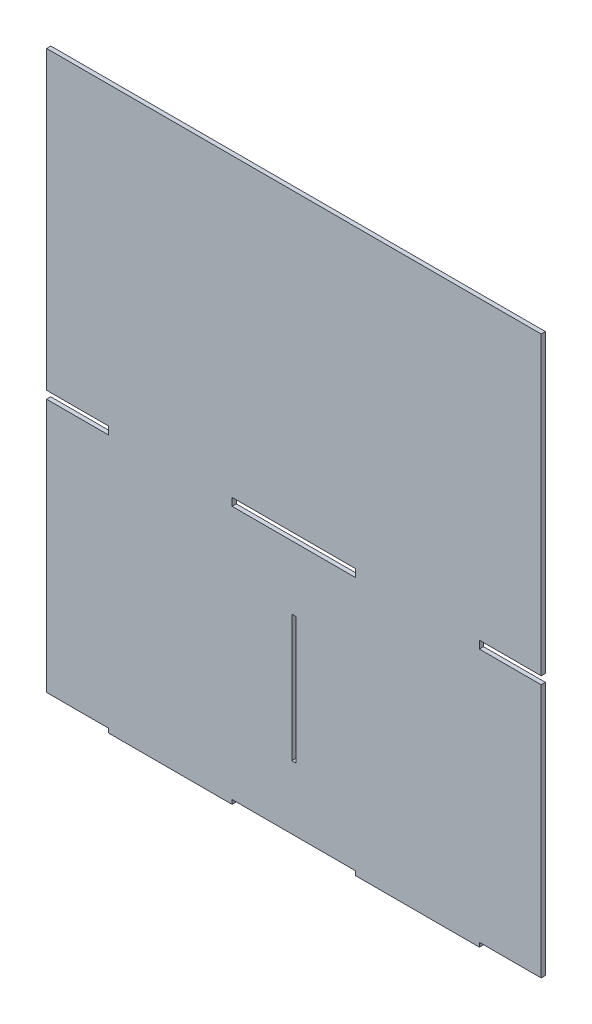
ISO-10303-21;
HEADER;
FILE_DESCRIPTION(('STEP AP214'),'2;1');
FILE_NAME('part.step','',(''),(''),'','','');
FILE_SCHEMA(('AUTOMOTIVE_DESIGN { 1 0 10303 214 1 1 1 1 }'));
ENDSEC;
DATA;
#1=APPLICATION_CONTEXT('core data for automotive mechanical design processes');
#2=APPLICATION_PROTOCOL_DEFINITION('international standard','automotive_design',2000,#1);
#3=PRODUCT_CONTEXT('',#1,'mechanical');
#4=PRODUCT('Part','Part','',(#3));
#5=PRODUCT_RELATED_PRODUCT_CATEGORY('part','',(#4));
#6=PRODUCT_DEFINITION_FORMATION('','',#4);
#7=PRODUCT_DEFINITION_CONTEXT('part definition',#1,'design');
#8=PRODUCT_DEFINITION('design','',#6,#7);
#9=PRODUCT_DEFINITION_SHAPE('','',#8);
#10=(LENGTH_UNIT() NAMED_UNIT(*) SI_UNIT(.MILLI.,.METRE.));
#11=(NAMED_UNIT(*) PLANE_ANGLE_UNIT() SI_UNIT($,.RADIAN.));
#12=(NAMED_UNIT(*) SI_UNIT($,.STERADIAN.) SOLID_ANGLE_UNIT());
#13=UNCERTAINTY_MEASURE_WITH_UNIT(LENGTH_MEASURE(1.E-05),#10,'distance_accuracy_value','');
#14=(GEOMETRIC_REPRESENTATION_CONTEXT(3) GLOBAL_UNCERTAINTY_ASSIGNED_CONTEXT((#13)) GLOBAL_UNIT_ASSIGNED_CONTEXT((#10,
#11,#12)) REPRESENTATION_CONTEXT('',''));
#15=CARTESIAN_POINT('',(0.,0.,0.));
#16=DIRECTION('',(0.,0.,1.));
#17=DIRECTION('',(1.,0.,0.));
#18=AXIS2_PLACEMENT_3D('',#15,#16,#17);
#19=CARTESIAN_POINT('',(0.,0.,3.));
#20=DIRECTION('',(0.,0.,-1.));
#21=DIRECTION('',(-1.,0.,0.));
#22=AXIS2_PLACEMENT_3D('',#19,#20,#21);
#23=PLANE('',#22);
#24=DIRECTION('',(1.,0.,0.));
#25=VECTOR('',#24,1.);
#26=CARTESIAN_POINT('',(-220.0509550125,180.76244654,3.));
#27=LINE('',#26,#25);
#28=CARTESIAN_POINT('',(-220.0509550125,180.76244654,3.));
#29=VERTEX_POINT('',#28);
#30=CARTESIAN_POINT('',(-132.0305730075,180.76244654,3.));
#31=VERTEX_POINT('',#30);
#32=EDGE_CURVE('E253',#29,#31,#27,.T.);
#33=ORIENTED_EDGE('',*,*,#32,.F.);
#34=DIRECTION('',(0.,-1.,0.));
#35=VECTOR('',#34,1.);
#36=CARTESIAN_POINT('',(-220.0509550125,186.26244654,3.));
#37=LINE('',#36,#35);
#38=CARTESIAN_POINT('',(-220.0509550125,186.26244654,3.));
#39=VERTEX_POINT('',#38);
#40=EDGE_CURVE('E261',#39,#29,#37,.T.);
#41=ORIENTED_EDGE('',*,*,#40,.F.);
#42=DIRECTION('',(-1.,0.,0.));
#43=VECTOR('',#42,1.);
#44=CARTESIAN_POINT('',(-220.0509550125,186.26244654,3.));
#45=LINE('',#44,#43);
#46=CARTESIAN_POINT('',(-132.0305730075,186.26244654,3.));
#47=VERTEX_POINT('',#46);
#48=EDGE_CURVE('E258',#47,#39,#45,.T.);
#49=ORIENTED_EDGE('',*,*,#48,.F.);
#50=DIRECTION('',(0.,1.,0.));
#51=VECTOR('',#50,1.);
#52=CARTESIAN_POINT('',(-132.0305730075,186.26244654,3.));
#53=LINE('',#52,#51);
#54=EDGE_CURVE('E255',#31,#47,#53,.T.);
#55=ORIENTED_EDGE('',*,*,#54,.F.);
#56=EDGE_LOOP('',(#33,#41,#49,#55));
#57=FACE_BOUND('',#56,.T.);
#58=DIRECTION('',(0.,1.,0.));
#59=VECTOR('',#58,1.);
#60=CARTESIAN_POINT('',(0.,0.,3.));
#61=LINE('',#60,#59);
#62=CARTESIAN_POINT('',(0.,0.,3.));
#63=VERTEX_POINT('',#62);
#64=CARTESIAN_POINT('',(0.,180.76244654,3.));
#65=VERTEX_POINT('',#64);
#66=EDGE_CURVE('E284',#63,#65,#61,.T.);
#67=ORIENTED_EDGE('',*,*,#66,.T.);
#68=DIRECTION('',(-1.,0.,0.));
#69=VECTOR('',#68,1.);
#70=CARTESIAN_POINT('',(-44.0101910024998,180.76244654,3.));
#71=LINE('',#70,#69);
#72=CARTESIAN_POINT('',(-44.0101910024998,180.76244654,3.));
#73=VERTEX_POINT('',#72);
#74=EDGE_CURVE('E287',#65,#73,#71,.T.);
#75=ORIENTED_EDGE('',*,*,#74,.T.);
#76=DIRECTION('',(0.,1.,0.));
#77=VECTOR('',#76,1.);
#78=CARTESIAN_POINT('',(-44.0101910024999,186.26244654,3.));
#79=LINE('',#78,#77);
#80=CARTESIAN_POINT('',(-44.0101910024999,186.26244654,3.));
#81=VERTEX_POINT('',#80);
#82=EDGE_CURVE('E290',#73,#81,#79,.T.);
#83=ORIENTED_EDGE('',*,*,#82,.T.);
#84=DIRECTION('',(1.,0.,0.));
#85=VECTOR('',#84,1.);
#86=CARTESIAN_POINT('',(-44.0101910024999,186.26244654,3.));
#87=LINE('',#86,#85);
#88=CARTESIAN_POINT('',(0.,186.26244654,3.));
#89=VERTEX_POINT('',#88);
#90=EDGE_CURVE('E292',#81,#89,#87,.T.);
#91=ORIENTED_EDGE('',*,*,#90,.T.);
#92=DIRECTION('',(0.,1.,0.));
#93=VECTOR('',#92,1.);
#94=CARTESIAN_POINT('',(0.,186.26244654,3.));
#95=LINE('',#94,#93);
#96=CARTESIAN_POINT('',(0.,397.,3.));
#97=VERTEX_POINT('',#96);
#98=EDGE_CURVE('E294',#89,#97,#95,.T.);
#99=ORIENTED_EDGE('',*,*,#98,.T.);
#100=DIRECTION('',(-1.,0.,0.));
#101=VECTOR('',#100,1.);
#102=CARTESIAN_POINT('',(0.,397.,3.));
#103=LINE('',#102,#101);
#104=CARTESIAN_POINT('',(-352.08152802,397.,3.));
#105=VERTEX_POINT('',#104);
#106=EDGE_CURVE('E296',#97,#105,#103,.T.);
#107=ORIENTED_EDGE('',*,*,#106,.T.);
#108=DIRECTION('',(0.,-1.,0.));
#109=VECTOR('',#108,1.);
#110=CARTESIAN_POINT('',(-352.08152802,186.26244654,3.));
#111=LINE('',#110,#109);
#112=CARTESIAN_POINT('',(-352.08152802,186.26244654,3.));
#113=VERTEX_POINT('',#112);
#114=EDGE_CURVE('E298',#105,#113,#111,.T.);
#115=ORIENTED_EDGE('',*,*,#114,.T.);
#116=DIRECTION('',(1.,0.,0.));
#117=VECTOR('',#116,1.);
#118=CARTESIAN_POINT('',(-308.0713370175,186.26244654,3.));
#119=LINE('',#118,#117);
#120=CARTESIAN_POINT('',(-308.0713370175,186.26244654,3.));
#121=VERTEX_POINT('',#120);
#122=EDGE_CURVE('E300',#113,#121,#119,.T.);
#123=ORIENTED_EDGE('',*,*,#122,.T.);
#124=DIRECTION('',(0.,-1.,0.));
#125=VECTOR('',#124,1.);
#126=CARTESIAN_POINT('',(-308.0713370175,186.26244654,3.));
#127=LINE('',#126,#125);
#128=CARTESIAN_POINT('',(-308.0713370175,180.76244654,3.));
#129=VERTEX_POINT('',#128);
#130=EDGE_CURVE('E302',#121,#129,#127,.T.);
#131=ORIENTED_EDGE('',*,*,#130,.T.);
#132=DIRECTION('',(-1.,0.,0.));
#133=VECTOR('',#132,1.);
#134=CARTESIAN_POINT('',(-308.0713370175,180.76244654,3.));
#135=LINE('',#134,#133);
#136=CARTESIAN_POINT('',(-352.08152802,180.76244654,3.));
#137=VERTEX_POINT('',#136);
#138=EDGE_CURVE('E304',#129,#137,#135,.T.);
#139=ORIENTED_EDGE('',*,*,#138,.T.);
#140=DIRECTION('',(0.,-1.,0.));
#141=VECTOR('',#140,1.);
#142=CARTESIAN_POINT('',(-352.08152802,0.,3.));
#143=LINE('',#142,#141);
#144=CARTESIAN_POINT('',(-352.08152802,0.,3.));
#145=VERTEX_POINT('',#144);
#146=EDGE_CURVE('E306',#137,#145,#143,.T.);
#147=ORIENTED_EDGE('',*,*,#146,.T.);
#148=DIRECTION('',(1.,0.,0.));
#149=VECTOR('',#148,1.);
#150=CARTESIAN_POINT('',(-308.0713370175,0.,3.));
#151=LINE('',#150,#149);
#152=CARTESIAN_POINT('',(-308.0713370175,0.,3.));
#153=VERTEX_POINT('',#152);
#154=EDGE_CURVE('E308',#145,#153,#151,.T.);
#155=ORIENTED_EDGE('',*,*,#154,.T.);
#156=DIRECTION('',(0.,-1.,0.));
#157=VECTOR('',#156,1.);
#158=CARTESIAN_POINT('',(-308.0713370175,0.,3.));
#159=LINE('',#158,#157);
#160=CARTESIAN_POINT('',(-308.0713370175,-3.,3.));
#161=VERTEX_POINT('',#160);
#162=EDGE_CURVE('E310',#153,#161,#159,.T.);
#163=ORIENTED_EDGE('',*,*,#162,.T.);
#164=DIRECTION('',(1.,0.,0.));
#165=VECTOR('',#164,1.);
#166=CARTESIAN_POINT('',(-308.0713370175,-3.,3.));
#167=LINE('',#166,#165);
#168=CARTESIAN_POINT('',(-220.0509550125,-3.,3.));
#169=VERTEX_POINT('',#168);
#170=EDGE_CURVE('E312',#161,#169,#167,.T.);
#171=ORIENTED_EDGE('',*,*,#170,.T.);
#172=DIRECTION('',(0.,1.,0.));
#173=VECTOR('',#172,1.);
#174=CARTESIAN_POINT('',(-220.0509550125,-3.,3.));
#175=LINE('',#174,#173);
#176=CARTESIAN_POINT('',(-220.0509550125,0.,3.));
#177=VERTEX_POINT('',#176);
#178=EDGE_CURVE('E314',#169,#177,#175,.T.);
#179=ORIENTED_EDGE('',*,*,#178,.T.);
#180=DIRECTION('',(1.,0.,0.));
#181=VECTOR('',#180,1.);
#182=CARTESIAN_POINT('',(-132.0313370175,0.,3.));
#183=LINE('',#182,#181);
#184=CARTESIAN_POINT('',(-132.0313370175,0.,3.));
#185=VERTEX_POINT('',#184);
#186=EDGE_CURVE('E316',#177,#185,#183,.T.);
#187=ORIENTED_EDGE('',*,*,#186,.T.);
#188=DIRECTION('',(0.,-1.,0.));
#189=VECTOR('',#188,1.);
#190=CARTESIAN_POINT('',(-132.0313370175,0.,3.));
#191=LINE('',#190,#189);
#192=CARTESIAN_POINT('',(-132.0313370175,-3.,3.));
#193=VERTEX_POINT('',#192);
#194=EDGE_CURVE('E318',#185,#193,#191,.T.);
#195=ORIENTED_EDGE('',*,*,#194,.T.);
#196=DIRECTION('',(1.,0.,0.));
#197=VECTOR('',#196,1.);
#198=CARTESIAN_POINT('',(-132.0313370175,-3.,3.));
#199=LINE('',#198,#197);
#200=CARTESIAN_POINT('',(-44.0109550125,-3.,3.));
#201=VERTEX_POINT('',#200);
#202=EDGE_CURVE('E320',#193,#201,#199,.T.);
#203=ORIENTED_EDGE('',*,*,#202,.T.);
#204=DIRECTION('',(0.,1.,0.));
#205=VECTOR('',#204,1.);
#206=CARTESIAN_POINT('',(-44.0109550125,-3.,3.));
#207=LINE('',#206,#205);
#208=CARTESIAN_POINT('',(-44.0109550125,0.,3.));
#209=VERTEX_POINT('',#208);
#210=EDGE_CURVE('E322',#201,#209,#207,.T.);
#211=ORIENTED_EDGE('',*,*,#210,.T.);
#212=DIRECTION('',(1.,0.,0.));
#213=VECTOR('',#212,1.);
#214=CARTESIAN_POINT('',(0.,0.,3.));
#215=LINE('',#214,#213);
#216=EDGE_CURVE('E324',#209,#63,#215,.T.);
#217=ORIENTED_EDGE('',*,*,#216,.T.);
#218=EDGE_LOOP('',(#67,#75,#83,#91,#99,#107,#115,#123,#131,#139,#147,#155,#163,#171,#179,#187,
#195,#203,#211,#217));
#219=FACE_BOUND('',#218,.T.);
#220=DIRECTION('',(0.,1.,0.));
#221=VECTOR('',#220,1.);
#222=CARTESIAN_POINT('',(-174.54076401,45.190611635,3.));
#223=LINE('',#222,#221);
#224=CARTESIAN_POINT('',(-174.54076401,45.190611635,3.));
#225=VERTEX_POINT('',#224);
#226=CARTESIAN_POINT('',(-174.54076401,135.571834905,3.));
#227=VERTEX_POINT('',#226);
#228=EDGE_CURVE('E217',#225,#227,#223,.T.);
#229=ORIENTED_EDGE('',*,*,#228,.F.);
#230=DIRECTION('',(1.,0.,0.));
#231=VECTOR('',#230,1.);
#232=CARTESIAN_POINT('',(-174.54076401,45.190611635,3.));
#233=LINE('',#232,#231);
#234=CARTESIAN_POINT('',(-177.54076401,45.190611635,3.));
#235=VERTEX_POINT('',#234);
#236=EDGE_CURVE('E239',#235,#225,#233,.T.);
#237=ORIENTED_EDGE('',*,*,#236,.F.);
#238=DIRECTION('',(0.,-1.,0.));
#239=VECTOR('',#238,1.);
#240=CARTESIAN_POINT('',(-177.54076401,45.190611635,3.));
#241=LINE('',#240,#239);
#242=CARTESIAN_POINT('',(-177.54076401,135.571834905,3.));
#243=VERTEX_POINT('',#242);
#244=EDGE_CURVE('E237',#243,#235,#241,.T.);
#245=ORIENTED_EDGE('',*,*,#244,.F.);
#246=DIRECTION('',(-1.,0.,0.));
#247=VECTOR('',#246,1.);
#248=CARTESIAN_POINT('',(-174.54076401,135.571834905,3.));
#249=LINE('',#248,#247);
#250=EDGE_CURVE('E225',#227,#243,#249,.T.);
#251=ORIENTED_EDGE('',*,*,#250,.F.);
#252=EDGE_LOOP('',(#229,#237,#245,#251));
#253=FACE_BOUND('',#252,.T.);
#254=ADVANCED_FACE('F32',(#57,#219,#253),#23,.F.);
#255=CARTESIAN_POINT('',(0.,0.,0.));
#256=DIRECTION('',(0.,0.,-1.));
#257=DIRECTION('',(-1.,0.,0.));
#258=AXIS2_PLACEMENT_3D('',#255,#256,#257);
#259=PLANE('',#258);
#260=DIRECTION('',(0.,1.,0.));
#261=VECTOR('',#260,1.);
#262=CARTESIAN_POINT('',(0.,0.,0.));
#263=LINE('',#262,#261);
#264=CARTESIAN_POINT('',(0.,0.,0.));
#265=VERTEX_POINT('',#264);
#266=CARTESIAN_POINT('',(0.,180.76244654,0.));
#267=VERTEX_POINT('',#266);
#268=EDGE_CURVE('E283',#265,#267,#263,.T.);
#269=ORIENTED_EDGE('',*,*,#268,.F.);
#270=DIRECTION('',(1.,0.,0.));
#271=VECTOR('',#270,1.);
#272=CARTESIAN_POINT('',(0.,0.,0.));
#273=LINE('',#272,#271);
#274=CARTESIAN_POINT('',(-44.0109550125,0.,0.));
#275=VERTEX_POINT('',#274);
#276=EDGE_CURVE('E288',#275,#265,#273,.T.);
#277=ORIENTED_EDGE('',*,*,#276,.F.);
#278=DIRECTION('',(0.,1.,0.));
#279=VECTOR('',#278,1.);
#280=CARTESIAN_POINT('',(-44.0109550125,-3.,0.));
#281=LINE('',#280,#279);
#282=CARTESIAN_POINT('',(-44.0109550125,-3.,0.));
#283=VERTEX_POINT('',#282);
#284=EDGE_CURVE('E363',#283,#275,#281,.T.);
#285=ORIENTED_EDGE('',*,*,#284,.F.);
#286=DIRECTION('',(1.,0.,0.));
#287=VECTOR('',#286,1.);
#288=CARTESIAN_POINT('',(-132.0313370175,-3.,0.));
#289=LINE('',#288,#287);
#290=CARTESIAN_POINT('',(-132.0313370175,-3.,0.));
#291=VERTEX_POINT('',#290);
#292=EDGE_CURVE('E361',#291,#283,#289,.T.);
#293=ORIENTED_EDGE('',*,*,#292,.F.);
#294=DIRECTION('',(0.,-1.,0.));
#295=VECTOR('',#294,1.);
#296=CARTESIAN_POINT('',(-132.0313370175,0.,0.));
#297=LINE('',#296,#295);
#298=CARTESIAN_POINT('',(-132.0313370175,0.,0.));
#299=VERTEX_POINT('',#298);
#300=EDGE_CURVE('E359',#299,#291,#297,.T.);
#301=ORIENTED_EDGE('',*,*,#300,.F.);
#302=DIRECTION('',(1.,0.,0.));
#303=VECTOR('',#302,1.);
#304=CARTESIAN_POINT('',(-132.0313370175,0.,0.));
#305=LINE('',#304,#303);
#306=CARTESIAN_POINT('',(-220.0509550125,0.,0.));
#307=VERTEX_POINT('',#306);
#308=EDGE_CURVE('E357',#307,#299,#305,.T.);
#309=ORIENTED_EDGE('',*,*,#308,.F.);
#310=DIRECTION('',(0.,1.,0.));
#311=VECTOR('',#310,1.);
#312=CARTESIAN_POINT('',(-220.0509550125,-3.,0.));
#313=LINE('',#312,#311);
#314=CARTESIAN_POINT('',(-220.0509550125,-3.,0.));
#315=VERTEX_POINT('',#314);
#316=EDGE_CURVE('E355',#315,#307,#313,.T.);
#317=ORIENTED_EDGE('',*,*,#316,.F.);
#318=DIRECTION('',(1.,0.,0.));
#319=VECTOR('',#318,1.);
#320=CARTESIAN_POINT('',(-308.0713370175,-3.,0.));
#321=LINE('',#320,#319);
#322=CARTESIAN_POINT('',(-308.0713370175,-3.,0.));
#323=VERTEX_POINT('',#322);
#324=EDGE_CURVE('E353',#323,#315,#321,.T.);
#325=ORIENTED_EDGE('',*,*,#324,.F.);
#326=DIRECTION('',(0.,-1.,0.));
#327=VECTOR('',#326,1.);
#328=CARTESIAN_POINT('',(-308.0713370175,0.,0.));
#329=LINE('',#328,#327);
#330=CARTESIAN_POINT('',(-308.0713370175,0.,0.));
#331=VERTEX_POINT('',#330);
#332=EDGE_CURVE('E351',#331,#323,#329,.T.);
#333=ORIENTED_EDGE('',*,*,#332,.F.);
#334=DIRECTION('',(1.,0.,0.));
#335=VECTOR('',#334,1.);
#336=CARTESIAN_POINT('',(-308.0713370175,0.,0.));
#337=LINE('',#336,#335);
#338=CARTESIAN_POINT('',(-352.08152802,0.,0.));
#339=VERTEX_POINT('',#338);
#340=EDGE_CURVE('E349',#339,#331,#337,.T.);
#341=ORIENTED_EDGE('',*,*,#340,.F.);
#342=DIRECTION('',(0.,-1.,0.));
#343=VECTOR('',#342,1.);
#344=CARTESIAN_POINT('',(-352.08152802,0.,0.));
#345=LINE('',#344,#343);
#346=CARTESIAN_POINT('',(-352.08152802,180.76244654,0.));
#347=VERTEX_POINT('',#346);
#348=EDGE_CURVE('E347',#347,#339,#345,.T.);
#349=ORIENTED_EDGE('',*,*,#348,.F.);
#350=DIRECTION('',(-1.,0.,0.));
#351=VECTOR('',#350,1.);
#352=CARTESIAN_POINT('',(-308.0713370175,180.76244654,0.));
#353=LINE('',#352,#351);
#354=CARTESIAN_POINT('',(-308.0713370175,180.76244654,0.));
#355=VERTEX_POINT('',#354);
#356=EDGE_CURVE('E345',#355,#347,#353,.T.);
#357=ORIENTED_EDGE('',*,*,#356,.F.);
#358=DIRECTION('',(0.,-1.,0.));
#359=VECTOR('',#358,1.);
#360=CARTESIAN_POINT('',(-308.0713370175,186.26244654,0.));
#361=LINE('',#360,#359);
#362=CARTESIAN_POINT('',(-308.0713370175,186.26244654,0.));
#363=VERTEX_POINT('',#362);
#364=EDGE_CURVE('E343',#363,#355,#361,.T.);
#365=ORIENTED_EDGE('',*,*,#364,.F.);
#366=DIRECTION('',(1.,0.,0.));
#367=VECTOR('',#366,1.);
#368=CARTESIAN_POINT('',(-308.0713370175,186.26244654,0.));
#369=LINE('',#368,#367);
#370=CARTESIAN_POINT('',(-352.08152802,186.26244654,0.));
#371=VERTEX_POINT('',#370);
#372=EDGE_CURVE('E341',#371,#363,#369,.T.);
#373=ORIENTED_EDGE('',*,*,#372,.F.);
#374=DIRECTION('',(0.,-1.,0.));
#375=VECTOR('',#374,1.);
#376=CARTESIAN_POINT('',(-352.08152802,186.26244654,0.));
#377=LINE('',#376,#375);
#378=CARTESIAN_POINT('',(-352.08152802,397.,0.));
#379=VERTEX_POINT('',#378);
#380=EDGE_CURVE('E339',#379,#371,#377,.T.);
#381=ORIENTED_EDGE('',*,*,#380,.F.);
#382=DIRECTION('',(-1.,0.,0.));
#383=VECTOR('',#382,1.);
#384=CARTESIAN_POINT('',(0.,397.,0.));
#385=LINE('',#384,#383);
#386=CARTESIAN_POINT('',(0.,397.,0.));
#387=VERTEX_POINT('',#386);
#388=EDGE_CURVE('E337',#387,#379,#385,.T.);
#389=ORIENTED_EDGE('',*,*,#388,.F.);
#390=DIRECTION('',(0.,1.,0.));
#391=VECTOR('',#390,1.);
#392=CARTESIAN_POINT('',(0.,186.26244654,0.));
#393=LINE('',#392,#391);
#394=CARTESIAN_POINT('',(0.,186.26244654,0.));
#395=VERTEX_POINT('',#394);
#396=EDGE_CURVE('E335',#395,#387,#393,.T.);
#397=ORIENTED_EDGE('',*,*,#396,.F.);
#398=DIRECTION('',(1.,0.,0.));
#399=VECTOR('',#398,1.);
#400=CARTESIAN_POINT('',(-44.0101910024999,186.26244654,0.));
#401=LINE('',#400,#399);
#402=CARTESIAN_POINT('',(-44.0101910024999,186.26244654,0.));
#403=VERTEX_POINT('',#402);
#404=EDGE_CURVE('E333',#403,#395,#401,.T.);
#405=ORIENTED_EDGE('',*,*,#404,.F.);
#406=DIRECTION('',(0.,1.,0.));
#407=VECTOR('',#406,1.);
#408=CARTESIAN_POINT('',(-44.0101910024999,186.26244654,0.));
#409=LINE('',#408,#407);
#410=CARTESIAN_POINT('',(-44.0101910024998,180.76244654,0.));
#411=VERTEX_POINT('',#410);
#412=EDGE_CURVE('E331',#411,#403,#409,.T.);
#413=ORIENTED_EDGE('',*,*,#412,.F.);
#414=DIRECTION('',(-1.,0.,0.));
#415=VECTOR('',#414,1.);
#416=CARTESIAN_POINT('',(-44.0101910024998,180.76244654,0.));
#417=LINE('',#416,#415);
#418=EDGE_CURVE('E329',#267,#411,#417,.T.);
#419=ORIENTED_EDGE('',*,*,#418,.F.);
#420=EDGE_LOOP('',(#269,#277,#285,#293,#301,#309,#317,#325,#333,#341,#349,#357,#365,#373,#381,
#389,#397,#405,#413,#419));
#421=FACE_BOUND('',#420,.T.);
#422=DIRECTION('',(0.,-1.,0.));
#423=VECTOR('',#422,1.);
#424=CARTESIAN_POINT('',(-220.0509550125,186.26244654,0.));
#425=LINE('',#424,#423);
#426=CARTESIAN_POINT('',(-220.0509550125,186.26244654,0.));
#427=VERTEX_POINT('',#426);
#428=CARTESIAN_POINT('',(-220.0509550125,180.76244654,0.));
#429=VERTEX_POINT('',#428);
#430=EDGE_CURVE('E256',#427,#429,#425,.T.);
#431=ORIENTED_EDGE('',*,*,#430,.T.);
#432=DIRECTION('',(1.,0.,0.));
#433=VECTOR('',#432,1.);
#434=CARTESIAN_POINT('',(-220.0509550125,180.76244654,0.));
#435=LINE('',#434,#433);
#436=CARTESIAN_POINT('',(-132.0305730075,180.76244654,0.));
#437=VERTEX_POINT('',#436);
#438=EDGE_CURVE('E233',#429,#437,#435,.T.);
#439=ORIENTED_EDGE('',*,*,#438,.T.);
#440=DIRECTION('',(0.,1.,0.));
#441=VECTOR('',#440,1.);
#442=CARTESIAN_POINT('',(-132.0305730075,186.26244654,0.));
#443=LINE('',#442,#441);
#444=CARTESIAN_POINT('',(-132.0305730075,186.26244654,0.));
#445=VERTEX_POINT('',#444);
#446=EDGE_CURVE('E266',#437,#445,#443,.T.);
#447=ORIENTED_EDGE('',*,*,#446,.T.);
#448=DIRECTION('',(-1.,0.,0.));
#449=VECTOR('',#448,1.);
#450=CARTESIAN_POINT('',(-220.0509550125,186.26244654,0.));
#451=LINE('',#450,#449);
#452=EDGE_CURVE('E269',#445,#427,#451,.T.);
#453=ORIENTED_EDGE('',*,*,#452,.T.);
#454=EDGE_LOOP('',(#431,#439,#447,#453));
#455=FACE_BOUND('',#454,.T.);
#456=DIRECTION('',(1.,0.,0.));
#457=VECTOR('',#456,1.);
#458=CARTESIAN_POINT('',(-174.54076401,45.190611635,0.));
#459=LINE('',#458,#457);
#460=CARTESIAN_POINT('',(-177.54076401,45.190611635,0.));
#461=VERTEX_POINT('',#460);
#462=CARTESIAN_POINT('',(-174.54076401,45.190611635,0.));
#463=VERTEX_POINT('',#462);
#464=EDGE_CURVE('E226',#461,#463,#459,.T.);
#465=ORIENTED_EDGE('',*,*,#464,.T.);
#466=DIRECTION('',(0.,1.,0.));
#467=VECTOR('',#466,1.);
#468=CARTESIAN_POINT('',(-174.54076401,45.190611635,0.));
#469=LINE('',#468,#467);
#470=CARTESIAN_POINT('',(-174.54076401,135.571834905,0.));
#471=VERTEX_POINT('',#470);
#472=EDGE_CURVE('E55',#463,#471,#469,.T.);
#473=ORIENTED_EDGE('',*,*,#472,.T.);
#474=DIRECTION('',(-1.,0.,0.));
#475=VECTOR('',#474,1.);
#476=CARTESIAN_POINT('',(-174.54076401,135.571834905,0.));
#477=LINE('',#476,#475);
#478=CARTESIAN_POINT('',(-177.54076401,135.571834905,0.));
#479=VERTEX_POINT('',#478);
#480=EDGE_CURVE('E232',#471,#479,#477,.T.);
#481=ORIENTED_EDGE('',*,*,#480,.T.);
#482=DIRECTION('',(0.,-1.,0.));
#483=VECTOR('',#482,1.);
#484=CARTESIAN_POINT('',(-177.54076401,45.190611635,0.));
#485=LINE('',#484,#483);
#486=EDGE_CURVE('E245',#479,#461,#485,.T.);
#487=ORIENTED_EDGE('',*,*,#486,.T.);
#488=EDGE_LOOP('',(#465,#473,#481,#487));
#489=FACE_BOUND('',#488,.T.);
#490=ADVANCED_FACE('F429',(#421,#455,#489),#259,.T.);
#491=CARTESIAN_POINT('',(0.,0.,3.));
#492=DIRECTION('',(-1.,0.,0.));
#493=DIRECTION('',(0.,0.,1.));
#494=AXIS2_PLACEMENT_3D('',#491,#492,#493);
#495=PLANE('',#494);
#496=ORIENTED_EDGE('',*,*,#268,.T.);
#497=DIRECTION('',(0.,0.,-1.));
#498=VECTOR('',#497,1.);
#499=CARTESIAN_POINT('',(0.,180.76244654,3.));
#500=LINE('',#499,#498);
#501=EDGE_CURVE('E11',#65,#267,#500,.T.);
#502=ORIENTED_EDGE('',*,*,#501,.F.);
#503=ORIENTED_EDGE('',*,*,#66,.F.);
#504=DIRECTION('',(0.,0.,-1.));
#505=VECTOR('',#504,1.);
#506=CARTESIAN_POINT('',(0.,0.,3.));
#507=LINE('',#506,#505);
#508=EDGE_CURVE('E326',#63,#265,#507,.T.);
#509=ORIENTED_EDGE('',*,*,#508,.T.);
#510=EDGE_LOOP('',(#496,#502,#503,#509));
#511=FACE_BOUND('',#510,.T.);
#512=ADVANCED_FACE('F34',(#511),#495,.F.);
#513=CARTESIAN_POINT('',(-44.0101910024998,180.76244654,3.));
#514=DIRECTION('',(0.,-1.,0.));
#515=DIRECTION('',(0.,0.,-1.));
#516=AXIS2_PLACEMENT_3D('',#513,#514,#515);
#517=PLANE('',#516);
#518=ORIENTED_EDGE('',*,*,#418,.T.);
#519=DIRECTION('',(0.,0.,-1.));
#520=VECTOR('',#519,1.);
#521=CARTESIAN_POINT('',(-44.0101910024998,180.76244654,3.));
#522=LINE('',#521,#520);
#523=EDGE_CURVE('E40',#73,#411,#522,.T.);
#524=ORIENTED_EDGE('',*,*,#523,.F.);
#525=ORIENTED_EDGE('',*,*,#74,.F.);
#526=ORIENTED_EDGE('',*,*,#501,.T.);
#527=EDGE_LOOP('',(#518,#524,#525,#526));
#528=FACE_BOUND('',#527,.T.);
#529=ADVANCED_FACE('F446',(#528),#517,.F.);
#530=CARTESIAN_POINT('',(-44.0101910024999,186.26244654,3.));
#531=DIRECTION('',(-1.,0.,0.));
#532=DIRECTION('',(0.,-1.,0.));
#533=AXIS2_PLACEMENT_3D('',#530,#531,#532);
#534=PLANE('',#533);
#535=ORIENTED_EDGE('',*,*,#412,.T.);
#536=DIRECTION('',(0.,0.,-1.));
#537=VECTOR('',#536,1.);
#538=CARTESIAN_POINT('',(-44.0101910024999,186.26244654,3.));
#539=LINE('',#538,#537);
#540=EDGE_CURVE('E416',#81,#403,#539,.T.);
#541=ORIENTED_EDGE('',*,*,#540,.F.);
#542=ORIENTED_EDGE('',*,*,#82,.F.);
#543=ORIENTED_EDGE('',*,*,#523,.T.);
#544=EDGE_LOOP('',(#535,#541,#542,#543));
#545=FACE_BOUND('',#544,.T.);
#546=ADVANCED_FACE('F423',(#545),#534,.F.);
#547=CARTESIAN_POINT('',(-44.0101910024999,186.26244654,3.));
#548=DIRECTION('',(0.,1.,0.));
#549=DIRECTION('',(0.,0.,1.));
#550=AXIS2_PLACEMENT_3D('',#547,#548,#549);
#551=PLANE('',#550);
#552=ORIENTED_EDGE('',*,*,#404,.T.);
#553=DIRECTION('',(0.,0.,-1.));
#554=VECTOR('',#553,1.);
#555=CARTESIAN_POINT('',(0.,186.26244654,3.));
#556=LINE('',#555,#554);
#557=EDGE_CURVE('E413',#89,#395,#556,.T.);
#558=ORIENTED_EDGE('',*,*,#557,.F.);
#559=ORIENTED_EDGE('',*,*,#90,.F.);
#560=ORIENTED_EDGE('',*,*,#540,.T.);
#561=EDGE_LOOP('',(#552,#558,#559,#560));
#562=FACE_BOUND('',#561,.T.);
#563=ADVANCED_FACE('F435',(#562),#551,.F.);
#564=CARTESIAN_POINT('',(0.,186.26244654,3.));
#565=DIRECTION('',(-1.,0.,0.));
#566=DIRECTION('',(0.,0.,1.));
#567=AXIS2_PLACEMENT_3D('',#564,#565,#566);
#568=PLANE('',#567);
#569=ORIENTED_EDGE('',*,*,#396,.T.);
#570=DIRECTION('',(0.,0.,-1.));
#571=VECTOR('',#570,1.);
#572=CARTESIAN_POINT('',(0.,397.,3.));
#573=LINE('',#572,#571);
#574=EDGE_CURVE('E410',#97,#387,#573,.T.);
#575=ORIENTED_EDGE('',*,*,#574,.F.);
#576=ORIENTED_EDGE('',*,*,#98,.F.);
#577=ORIENTED_EDGE('',*,*,#557,.T.);
#578=EDGE_LOOP('',(#569,#575,#576,#577));
#579=FACE_BOUND('',#578,.T.);
#580=ADVANCED_FACE('F439',(#579),#568,.F.);
#581=CARTESIAN_POINT('',(0.,397.,3.));
#582=DIRECTION('',(0.,-1.,0.));
#583=DIRECTION('',(1.,0.,0.));
#584=AXIS2_PLACEMENT_3D('',#581,#582,#583);
#585=PLANE('',#584);
#586=ORIENTED_EDGE('',*,*,#388,.T.);
#587=DIRECTION('',(0.,0.,-1.));
#588=VECTOR('',#587,1.);
#589=CARTESIAN_POINT('',(-352.08152802,397.,3.));
#590=LINE('',#589,#588);
#591=EDGE_CURVE('E407',#105,#379,#590,.T.);
#592=ORIENTED_EDGE('',*,*,#591,.F.);
#593=ORIENTED_EDGE('',*,*,#106,.F.);
#594=ORIENTED_EDGE('',*,*,#574,.T.);
#595=EDGE_LOOP('',(#586,#592,#593,#594));
#596=FACE_BOUND('',#595,.T.);
#597=ADVANCED_FACE('F519',(#596),#585,.F.);
#598=CARTESIAN_POINT('',(-352.08152802,186.26244654,3.));
#599=DIRECTION('',(1.,0.,0.));
#600=DIRECTION('',(0.,1.,0.));
#601=AXIS2_PLACEMENT_3D('',#598,#599,#600);
#602=PLANE('',#601);
#603=ORIENTED_EDGE('',*,*,#380,.T.);
#604=DIRECTION('',(0.,0.,-1.));
#605=VECTOR('',#604,1.);
#606=CARTESIAN_POINT('',(-352.08152802,186.26244654,3.));
#607=LINE('',#606,#605);
#608=EDGE_CURVE('E404',#113,#371,#607,.T.);
#609=ORIENTED_EDGE('',*,*,#608,.F.);
#610=ORIENTED_EDGE('',*,*,#114,.F.);
#611=ORIENTED_EDGE('',*,*,#591,.T.);
#612=EDGE_LOOP('',(#603,#609,#610,#611));
#613=FACE_BOUND('',#612,.T.);
#614=ADVANCED_FACE('F517',(#613),#602,.F.);
#615=CARTESIAN_POINT('',(-308.0713370175,186.26244654,3.));
#616=DIRECTION('',(0.,1.,0.));
#617=DIRECTION('',(0.,0.,1.));
#618=AXIS2_PLACEMENT_3D('',#615,#616,#617);
#619=PLANE('',#618);
#620=ORIENTED_EDGE('',*,*,#372,.T.);
#621=DIRECTION('',(0.,0.,-1.));
#622=VECTOR('',#621,1.);
#623=CARTESIAN_POINT('',(-308.0713370175,186.26244654,3.));
#624=LINE('',#623,#622);
#625=EDGE_CURVE('E401',#121,#363,#624,.T.);
#626=ORIENTED_EDGE('',*,*,#625,.F.);
#627=ORIENTED_EDGE('',*,*,#122,.F.);
#628=ORIENTED_EDGE('',*,*,#608,.T.);
#629=EDGE_LOOP('',(#620,#626,#627,#628));
#630=FACE_BOUND('',#629,.T.);
#631=ADVANCED_FACE('F512',(#630),#619,.F.);
#632=CARTESIAN_POINT('',(-308.0713370175,186.26244654,3.));
#633=DIRECTION('',(1.,0.,0.));
#634=DIRECTION('',(0.,1.,0.));
#635=AXIS2_PLACEMENT_3D('',#632,#633,#634);
#636=PLANE('',#635);
#637=ORIENTED_EDGE('',*,*,#364,.T.);
#638=DIRECTION('',(0.,0.,-1.));
#639=VECTOR('',#638,1.);
#640=CARTESIAN_POINT('',(-308.0713370175,180.76244654,3.));
#641=LINE('',#640,#639);
#642=EDGE_CURVE('E398',#129,#355,#641,.T.);
#643=ORIENTED_EDGE('',*,*,#642,.F.);
#644=ORIENTED_EDGE('',*,*,#130,.F.);
#645=ORIENTED_EDGE('',*,*,#625,.T.);
#646=EDGE_LOOP('',(#637,#643,#644,#645));
#647=FACE_BOUND('',#646,.T.);
#648=ADVANCED_FACE('F507',(#647),#636,.F.);
#649=CARTESIAN_POINT('',(-308.0713370175,180.76244654,3.));
#650=DIRECTION('',(0.,-1.,0.));
#651=DIRECTION('',(0.,0.,-1.));
#652=AXIS2_PLACEMENT_3D('',#649,#650,#651);
#653=PLANE('',#652);
#654=ORIENTED_EDGE('',*,*,#356,.T.);
#655=DIRECTION('',(0.,0.,-1.));
#656=VECTOR('',#655,1.);
#657=CARTESIAN_POINT('',(-352.08152802,180.76244654,3.));
#658=LINE('',#657,#656);
#659=EDGE_CURVE('E395',#137,#347,#658,.T.);
#660=ORIENTED_EDGE('',*,*,#659,.F.);
#661=ORIENTED_EDGE('',*,*,#138,.F.);
#662=ORIENTED_EDGE('',*,*,#642,.T.);
#663=EDGE_LOOP('',(#654,#660,#661,#662));
#664=FACE_BOUND('',#663,.T.);
#665=ADVANCED_FACE('F503',(#664),#653,.F.);
#666=CARTESIAN_POINT('',(-352.08152802,0.,3.));
#667=DIRECTION('',(1.,0.,0.));
#668=DIRECTION('',(0.,0.,-1.));
#669=AXIS2_PLACEMENT_3D('',#666,#667,#668);
#670=PLANE('',#669);
#671=ORIENTED_EDGE('',*,*,#348,.T.);
#672=DIRECTION('',(0.,0.,-1.));
#673=VECTOR('',#672,1.);
#674=CARTESIAN_POINT('',(-352.08152802,0.,3.));
#675=LINE('',#674,#673);
#676=EDGE_CURVE('E392',#145,#339,#675,.T.);
#677=ORIENTED_EDGE('',*,*,#676,.F.);
#678=ORIENTED_EDGE('',*,*,#146,.F.);
#679=ORIENTED_EDGE('',*,*,#659,.T.);
#680=EDGE_LOOP('',(#671,#677,#678,#679));
#681=FACE_BOUND('',#680,.T.);
#682=ADVANCED_FACE('F498',(#681),#670,.F.);
#683=CARTESIAN_POINT('',(-308.0713370175,0.,3.));
#684=DIRECTION('',(0.,1.,0.));
#685=DIRECTION('',(-1.,0.,0.));
#686=AXIS2_PLACEMENT_3D('',#683,#684,#685);
#687=PLANE('',#686);
#688=ORIENTED_EDGE('',*,*,#340,.T.);
#689=DIRECTION('',(0.,0.,-1.));
#690=VECTOR('',#689,1.);
#691=CARTESIAN_POINT('',(-308.0713370175,0.,3.));
#692=LINE('',#691,#690);
#693=EDGE_CURVE('E389',#153,#331,#692,.T.);
#694=ORIENTED_EDGE('',*,*,#693,.F.);
#695=ORIENTED_EDGE('',*,*,#154,.F.);
#696=ORIENTED_EDGE('',*,*,#676,.T.);
#697=EDGE_LOOP('',(#688,#694,#695,#696));
#698=FACE_BOUND('',#697,.T.);
#699=ADVANCED_FACE('F492',(#698),#687,.F.);
#700=CARTESIAN_POINT('',(-308.0713370175,0.,3.));
#701=DIRECTION('',(1.,0.,0.));
#702=DIRECTION('',(0.,0.,-1.));
#703=AXIS2_PLACEMENT_3D('',#700,#701,#702);
#704=PLANE('',#703);
#705=ORIENTED_EDGE('',*,*,#332,.T.);
#706=DIRECTION('',(0.,0.,-1.));
#707=VECTOR('',#706,1.);
#708=CARTESIAN_POINT('',(-308.0713370175,-3.,3.));
#709=LINE('',#708,#707);
#710=EDGE_CURVE('E386',#161,#323,#709,.T.);
#711=ORIENTED_EDGE('',*,*,#710,.F.);
#712=ORIENTED_EDGE('',*,*,#162,.F.);
#713=ORIENTED_EDGE('',*,*,#693,.T.);
#714=EDGE_LOOP('',(#705,#711,#712,#713));
#715=FACE_BOUND('',#714,.T.);
#716=ADVANCED_FACE('F488',(#715),#704,.F.);
#717=CARTESIAN_POINT('',(-308.0713370175,-3.,3.));
#718=DIRECTION('',(0.,1.,0.));
#719=DIRECTION('',(0.,0.,1.));
#720=AXIS2_PLACEMENT_3D('',#717,#718,#719);
#721=PLANE('',#720);
#722=ORIENTED_EDGE('',*,*,#324,.T.);
#723=DIRECTION('',(0.,0.,-1.));
#724=VECTOR('',#723,1.);
#725=CARTESIAN_POINT('',(-220.0509550125,-3.,3.));
#726=LINE('',#725,#724);
#727=EDGE_CURVE('E383',#169,#315,#726,.T.);
#728=ORIENTED_EDGE('',*,*,#727,.F.);
#729=ORIENTED_EDGE('',*,*,#170,.F.);
#730=ORIENTED_EDGE('',*,*,#710,.T.);
#731=EDGE_LOOP('',(#722,#728,#729,#730));
#732=FACE_BOUND('',#731,.T.);
#733=ADVANCED_FACE('F483',(#732),#721,.F.);
#734=CARTESIAN_POINT('',(-220.0509550125,-3.,3.));
#735=DIRECTION('',(-1.,0.,0.));
#736=DIRECTION('',(0.,0.,1.));
#737=AXIS2_PLACEMENT_3D('',#734,#735,#736);
#738=PLANE('',#737);
#739=ORIENTED_EDGE('',*,*,#316,.T.);
#740=DIRECTION('',(0.,0.,-1.));
#741=VECTOR('',#740,1.);
#742=CARTESIAN_POINT('',(-220.0509550125,0.,3.));
#743=LINE('',#742,#741);
#744=EDGE_CURVE('E380',#177,#307,#743,.T.);
#745=ORIENTED_EDGE('',*,*,#744,.F.);
#746=ORIENTED_EDGE('',*,*,#178,.F.);
#747=ORIENTED_EDGE('',*,*,#727,.T.);
#748=EDGE_LOOP('',(#739,#745,#746,#747));
#749=FACE_BOUND('',#748,.T.);
#750=ADVANCED_FACE('F477',(#749),#738,.F.);
#751=CARTESIAN_POINT('',(-132.0313370175,0.,3.));
#752=DIRECTION('',(0.,1.,0.));
#753=DIRECTION('',(-1.,0.,0.));
#754=AXIS2_PLACEMENT_3D('',#751,#752,#753);
#755=PLANE('',#754);
#756=ORIENTED_EDGE('',*,*,#308,.T.);
#757=DIRECTION('',(0.,0.,-1.));
#758=VECTOR('',#757,1.);
#759=CARTESIAN_POINT('',(-132.0313370175,0.,3.));
#760=LINE('',#759,#758);
#761=EDGE_CURVE('E377',#185,#299,#760,.T.);
#762=ORIENTED_EDGE('',*,*,#761,.F.);
#763=ORIENTED_EDGE('',*,*,#186,.F.);
#764=ORIENTED_EDGE('',*,*,#744,.T.);
#765=EDGE_LOOP('',(#756,#762,#763,#764));
#766=FACE_BOUND('',#765,.T.);
#767=ADVANCED_FACE('F473',(#766),#755,.F.);
#768=CARTESIAN_POINT('',(-132.0313370175,0.,3.));
#769=DIRECTION('',(1.,0.,0.));
#770=DIRECTION('',(0.,0.,-1.));
#771=AXIS2_PLACEMENT_3D('',#768,#769,#770);
#772=PLANE('',#771);
#773=ORIENTED_EDGE('',*,*,#300,.T.);
#774=DIRECTION('',(0.,0.,-1.));
#775=VECTOR('',#774,1.);
#776=CARTESIAN_POINT('',(-132.0313370175,-3.,3.));
#777=LINE('',#776,#775);
#778=EDGE_CURVE('E374',#193,#291,#777,.T.);
#779=ORIENTED_EDGE('',*,*,#778,.F.);
#780=ORIENTED_EDGE('',*,*,#194,.F.);
#781=ORIENTED_EDGE('',*,*,#761,.T.);
#782=EDGE_LOOP('',(#773,#779,#780,#781));
#783=FACE_BOUND('',#782,.T.);
#784=ADVANCED_FACE('F468',(#783),#772,.F.);
#785=CARTESIAN_POINT('',(-132.0313370175,-3.,3.));
#786=DIRECTION('',(0.,1.,0.));
#787=DIRECTION('',(0.,0.,1.));
#788=AXIS2_PLACEMENT_3D('',#785,#786,#787);
#789=PLANE('',#788);
#790=ORIENTED_EDGE('',*,*,#292,.T.);
#791=DIRECTION('',(0.,0.,-1.));
#792=VECTOR('',#791,1.);
#793=CARTESIAN_POINT('',(-44.0109550125,-3.,3.));
#794=LINE('',#793,#792);
#795=EDGE_CURVE('E371',#201,#283,#794,.T.);
#796=ORIENTED_EDGE('',*,*,#795,.F.);
#797=ORIENTED_EDGE('',*,*,#202,.F.);
#798=ORIENTED_EDGE('',*,*,#778,.T.);
#799=EDGE_LOOP('',(#790,#796,#797,#798));
#800=FACE_BOUND('',#799,.T.);
#801=ADVANCED_FACE('F462',(#800),#789,.F.);
#802=CARTESIAN_POINT('',(-44.0109550125,-3.,3.));
#803=DIRECTION('',(-1.,0.,0.));
#804=DIRECTION('',(0.,0.,1.));
#805=AXIS2_PLACEMENT_3D('',#802,#803,#804);
#806=PLANE('',#805);
#807=ORIENTED_EDGE('',*,*,#284,.T.);
#808=DIRECTION('',(0.,0.,-1.));
#809=VECTOR('',#808,1.);
#810=CARTESIAN_POINT('',(-44.0109550125,0.,3.));
#811=LINE('',#810,#809);
#812=EDGE_CURVE('E368',#209,#275,#811,.T.);
#813=ORIENTED_EDGE('',*,*,#812,.F.);
#814=ORIENTED_EDGE('',*,*,#210,.F.);
#815=ORIENTED_EDGE('',*,*,#795,.T.);
#816=EDGE_LOOP('',(#807,#813,#814,#815));
#817=FACE_BOUND('',#816,.T.);
#818=ADVANCED_FACE('F458',(#817),#806,.F.);
#819=CARTESIAN_POINT('',(0.,0.,3.));
#820=DIRECTION('',(0.,1.,0.));
#821=DIRECTION('',(-1.,0.,0.));
#822=AXIS2_PLACEMENT_3D('',#819,#820,#821);
#823=PLANE('',#822);
#824=ORIENTED_EDGE('',*,*,#276,.T.);
#825=ORIENTED_EDGE('',*,*,#508,.F.);
#826=ORIENTED_EDGE('',*,*,#216,.F.);
#827=ORIENTED_EDGE('',*,*,#812,.T.);
#828=EDGE_LOOP('',(#824,#825,#826,#827));
#829=FACE_BOUND('',#828,.T.);
#830=ADVANCED_FACE('F453',(#829),#823,.F.);
#831=CARTESIAN_POINT('',(-220.0509550125,180.76244654,3.));
#832=DIRECTION('',(0.,1.,0.));
#833=DIRECTION('',(0.,0.,1.));
#834=AXIS2_PLACEMENT_3D('',#831,#832,#833);
#835=PLANE('',#834);
#836=ORIENTED_EDGE('',*,*,#438,.F.);
#837=DIRECTION('',(0.,0.,-1.));
#838=VECTOR('',#837,1.);
#839=CARTESIAN_POINT('',(-220.0509550125,180.76244654,3.));
#840=LINE('',#839,#838);
#841=EDGE_CURVE('E263',#29,#429,#840,.T.);
#842=ORIENTED_EDGE('',*,*,#841,.F.);
#843=ORIENTED_EDGE('',*,*,#32,.T.);
#844=DIRECTION('',(0.,0.,-1.));
#845=VECTOR('',#844,1.);
#846=CARTESIAN_POINT('',(-132.0305730075,180.76244654,3.));
#847=LINE('',#846,#845);
#848=EDGE_CURVE('E280',#31,#437,#847,.T.);
#849=ORIENTED_EDGE('',*,*,#848,.T.);
#850=EDGE_LOOP('',(#836,#842,#843,#849));
#851=FACE_BOUND('',#850,.T.);
#852=ADVANCED_FACE('F537',(#851),#835,.T.);
#853=CARTESIAN_POINT('',(-132.0305730075,186.26244654,3.));
#854=DIRECTION('',(-1.,0.,0.));
#855=DIRECTION('',(0.,-1.,0.));
#856=AXIS2_PLACEMENT_3D('',#853,#854,#855);
#857=PLANE('',#856);
#858=ORIENTED_EDGE('',*,*,#446,.F.);
#859=ORIENTED_EDGE('',*,*,#848,.F.);
#860=ORIENTED_EDGE('',*,*,#54,.T.);
#861=DIRECTION('',(0.,0.,-1.));
#862=VECTOR('',#861,1.);
#863=CARTESIAN_POINT('',(-132.0305730075,186.26244654,3.));
#864=LINE('',#863,#862);
#865=EDGE_CURVE('E278',#47,#445,#864,.T.);
#866=ORIENTED_EDGE('',*,*,#865,.T.);
#867=EDGE_LOOP('',(#858,#859,#860,#866));
#868=FACE_BOUND('',#867,.T.);
#869=ADVANCED_FACE('F623',(#868),#857,.T.);
#870=CARTESIAN_POINT('',(-220.0509550125,186.26244654,3.));
#871=DIRECTION('',(0.,-1.,0.));
#872=DIRECTION('',(0.,0.,-1.));
#873=AXIS2_PLACEMENT_3D('',#870,#871,#872);
#874=PLANE('',#873);
#875=ORIENTED_EDGE('',*,*,#452,.F.);
#876=ORIENTED_EDGE('',*,*,#865,.F.);
#877=ORIENTED_EDGE('',*,*,#48,.T.);
#878=DIRECTION('',(0.,0.,-1.));
#879=VECTOR('',#878,1.);
#880=CARTESIAN_POINT('',(-220.0509550125,186.26244654,3.));
#881=LINE('',#880,#879);
#882=EDGE_CURVE('E276',#39,#427,#881,.T.);
#883=ORIENTED_EDGE('',*,*,#882,.T.);
#884=EDGE_LOOP('',(#875,#876,#877,#883));
#885=FACE_BOUND('',#884,.T.);
#886=ADVANCED_FACE('F630',(#885),#874,.T.);
#887=CARTESIAN_POINT('',(-220.0509550125,186.26244654,3.));
#888=DIRECTION('',(1.,0.,0.));
#889=DIRECTION('',(0.,0.,-1.));
#890=AXIS2_PLACEMENT_3D('',#887,#888,#889);
#891=PLANE('',#890);
#892=ORIENTED_EDGE('',*,*,#430,.F.);
#893=ORIENTED_EDGE('',*,*,#882,.F.);
#894=ORIENTED_EDGE('',*,*,#40,.T.);
#895=ORIENTED_EDGE('',*,*,#841,.T.);
#896=EDGE_LOOP('',(#892,#893,#894,#895));
#897=FACE_BOUND('',#896,.T.);
#898=ADVANCED_FACE('F637',(#897),#891,.T.);
#899=CARTESIAN_POINT('',(-174.54076401,45.190611635,3.));
#900=DIRECTION('',(-1.,0.,0.));
#901=DIRECTION('',(0.,-1.,0.));
#902=AXIS2_PLACEMENT_3D('',#899,#900,#901);
#903=PLANE('',#902);
#904=ORIENTED_EDGE('',*,*,#472,.F.);
#905=DIRECTION('',(0.,0.,-1.));
#906=VECTOR('',#905,1.);
#907=CARTESIAN_POINT('',(-174.54076401,45.190611635,3.));
#908=LINE('',#907,#906);
#909=EDGE_CURVE('E221',#225,#463,#908,.T.);
#910=ORIENTED_EDGE('',*,*,#909,.F.);
#911=ORIENTED_EDGE('',*,*,#228,.T.);
#912=DIRECTION('',(0.,0.,-1.));
#913=VECTOR('',#912,1.);
#914=CARTESIAN_POINT('',(-174.54076401,135.571834905,3.));
#915=LINE('',#914,#913);
#916=EDGE_CURVE('E220',#227,#471,#915,.T.);
#917=ORIENTED_EDGE('',*,*,#916,.T.);
#918=EDGE_LOOP('',(#904,#910,#911,#917));
#919=FACE_BOUND('',#918,.T.);
#920=ADVANCED_FACE('F219',(#919),#903,.T.);
#921=CARTESIAN_POINT('',(-174.54076401,135.571834905,3.));
#922=DIRECTION('',(0.,-1.,0.));
#923=DIRECTION('',(0.,0.,-1.));
#924=AXIS2_PLACEMENT_3D('',#921,#922,#923);
#925=PLANE('',#924);
#926=ORIENTED_EDGE('',*,*,#480,.F.);
#927=ORIENTED_EDGE('',*,*,#916,.F.);
#928=ORIENTED_EDGE('',*,*,#250,.T.);
#929=DIRECTION('',(0.,0.,-1.));
#930=VECTOR('',#929,1.);
#931=CARTESIAN_POINT('',(-177.54076401,135.571834905,3.));
#932=LINE('',#931,#930);
#933=EDGE_CURVE('E234',#243,#479,#932,.T.);
#934=ORIENTED_EDGE('',*,*,#933,.T.);
#935=EDGE_LOOP('',(#926,#927,#928,#934));
#936=FACE_BOUND('',#935,.T.);
#937=ADVANCED_FACE('F229',(#936),#925,.T.);
#938=CARTESIAN_POINT('',(-177.54076401,45.190611635,3.));
#939=DIRECTION('',(1.,0.,0.));
#940=DIRECTION('',(0.,0.,-1.));
#941=AXIS2_PLACEMENT_3D('',#938,#939,#940);
#942=PLANE('',#941);
#943=ORIENTED_EDGE('',*,*,#486,.F.);
#944=ORIENTED_EDGE('',*,*,#933,.F.);
#945=ORIENTED_EDGE('',*,*,#244,.T.);
#946=DIRECTION('',(0.,0.,-1.));
#947=VECTOR('',#946,1.);
#948=CARTESIAN_POINT('',(-177.54076401,45.190611635,3.));
#949=LINE('',#948,#947);
#950=EDGE_CURVE('E47',#235,#461,#949,.T.);
#951=ORIENTED_EDGE('',*,*,#950,.T.);
#952=EDGE_LOOP('',(#943,#944,#945,#951));
#953=FACE_BOUND('',#952,.T.);
#954=ADVANCED_FACE('F658',(#953),#942,.T.);
#955=CARTESIAN_POINT('',(-174.54076401,45.190611635,3.));
#956=DIRECTION('',(0.,1.,0.));
#957=DIRECTION('',(0.,0.,1.));
#958=AXIS2_PLACEMENT_3D('',#955,#956,#957);
#959=PLANE('',#958);
#960=ORIENTED_EDGE('',*,*,#464,.F.);
#961=ORIENTED_EDGE('',*,*,#950,.F.);
#962=ORIENTED_EDGE('',*,*,#236,.T.);
#963=ORIENTED_EDGE('',*,*,#909,.T.);
#964=EDGE_LOOP('',(#960,#961,#962,#963));
#965=FACE_BOUND('',#964,.T.);
#966=ADVANCED_FACE('F665',(#965),#959,.T.);
#967=CLOSED_SHELL('',(#254,#490,#512,#529,#546,#563,#580,#597,#614,#631,#648,#665,#682,#699,
#716,#733,#750,#767,#784,#801,#818,#830,#852,#869,#886,#898,#920,#937,#954,#966));
#968=MANIFOLD_SOLID_BREP('B2',#967);
#969=ADVANCED_BREP_SHAPE_REPRESENTATION('',(#18,#968),#14);
#970=SHAPE_DEFINITION_REPRESENTATION(#9,#969);
ENDSEC;
END-ISO-10303-21;
